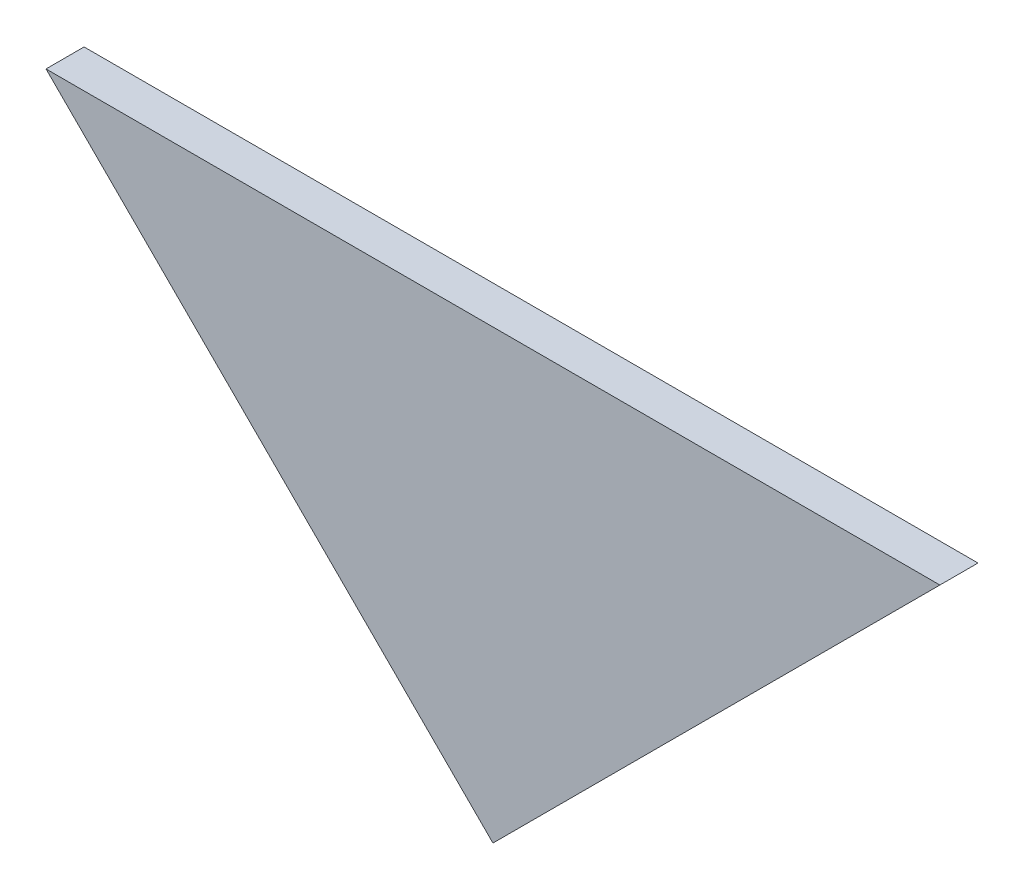
ISO-10303-21;
HEADER;
FILE_DESCRIPTION(('STEP AP214'),'2;1');
FILE_NAME('part.step','',(''),(''),'','','');
FILE_SCHEMA(('AUTOMOTIVE_DESIGN { 1 0 10303 214 1 1 1 1 }'));
ENDSEC;
DATA;
#1=APPLICATION_CONTEXT('core data for automotive mechanical design processes');
#2=APPLICATION_PROTOCOL_DEFINITION('international standard','automotive_design',2000,#1);
#3=PRODUCT_CONTEXT('',#1,'mechanical');
#4=PRODUCT('Part','Part','',(#3));
#5=PRODUCT_RELATED_PRODUCT_CATEGORY('part','',(#4));
#6=PRODUCT_DEFINITION_FORMATION('','',#4);
#7=PRODUCT_DEFINITION_CONTEXT('part definition',#1,'design');
#8=PRODUCT_DEFINITION('design','',#6,#7);
#9=PRODUCT_DEFINITION_SHAPE('','',#8);
#10=(LENGTH_UNIT() NAMED_UNIT(*) SI_UNIT(.MILLI.,.METRE.));
#11=(NAMED_UNIT(*) PLANE_ANGLE_UNIT() SI_UNIT($,.RADIAN.));
#12=(NAMED_UNIT(*) SI_UNIT($,.STERADIAN.) SOLID_ANGLE_UNIT());
#13=UNCERTAINTY_MEASURE_WITH_UNIT(LENGTH_MEASURE(1.E-05),#10,'distance_accuracy_value','');
#14=(GEOMETRIC_REPRESENTATION_CONTEXT(3) GLOBAL_UNCERTAINTY_ASSIGNED_CONTEXT((#13)) GLOBAL_UNIT_ASSIGNED_CONTEXT((#10,
#11,#12)) REPRESENTATION_CONTEXT('',''));
#15=CARTESIAN_POINT('',(0.,0.,0.));
#16=DIRECTION('',(0.,0.,1.));
#17=DIRECTION('',(1.,0.,0.));
#18=AXIS2_PLACEMENT_3D('',#15,#16,#17);
#19=CARTESIAN_POINT('',(172.189194744263,37.4911311616296,11.90625));
#20=DIRECTION('',(0.,-1.,0.));
#21=DIRECTION('',(1.,0.,0.));
#22=AXIS2_PLACEMENT_3D('',#19,#20,#21);
#23=PLANE('',#22);
#24=DIRECTION('',(-1.,0.,0.));
#25=VECTOR('',#24,1.);
#26=CARTESIAN_POINT('',(172.189194744263,37.4911311616296,0.));
#27=LINE('',#26,#25);
#28=CARTESIAN_POINT('',(172.189194744263,37.4911311616296,0.));
#29=VERTEX_POINT('',#28);
#30=CARTESIAN_POINT('',(-107.210805255737,37.4911311616296,0.));
#31=VERTEX_POINT('',#30);
#32=EDGE_CURVE('E79',#29,#31,#27,.T.);
#33=ORIENTED_EDGE('',*,*,#32,.T.);
#34=DIRECTION('',(0.,0.,-1.));
#35=VECTOR('',#34,1.);
#36=CARTESIAN_POINT('',(-107.210805255737,37.4911311616296,11.90625));
#37=LINE('',#36,#35);
#38=CARTESIAN_POINT('',(-107.210805255737,37.4911311616296,11.90625));
#39=VERTEX_POINT('',#38);
#40=EDGE_CURVE('E11',#39,#31,#37,.T.);
#41=ORIENTED_EDGE('',*,*,#40,.F.);
#42=DIRECTION('',(-1.,0.,0.));
#43=VECTOR('',#42,1.);
#44=CARTESIAN_POINT('',(172.189194744263,37.4911311616296,11.90625));
#45=LINE('',#44,#43);
#46=CARTESIAN_POINT('',(172.189194744263,37.4911311616296,11.90625));
#47=VERTEX_POINT('',#46);
#48=EDGE_CURVE('E72',#47,#39,#45,.T.);
#49=ORIENTED_EDGE('',*,*,#48,.F.);
#50=DIRECTION('',(0.,0.,-1.));
#51=VECTOR('',#50,1.);
#52=CARTESIAN_POINT('',(172.189194744263,37.4911311616296,11.90625));
#53=LINE('',#52,#51);
#54=EDGE_CURVE('E80',#47,#29,#53,.T.);
#55=ORIENTED_EDGE('',*,*,#54,.T.);
#56=EDGE_LOOP('',(#33,#41,#49,#55));
#57=FACE_BOUND('',#56,.T.);
#58=ADVANCED_FACE('F32',(#57),#23,.F.);
#59=CARTESIAN_POINT('',(-107.210805255737,37.4911311616296,11.90625));
#60=DIRECTION('',(0.707106781186543,0.707106781186552,0.));
#61=DIRECTION('',(-0.707106781186552,0.707106781186543,0.));
#62=AXIS2_PLACEMENT_3D('',#59,#60,#61);
#63=PLANE('',#62);
#64=DIRECTION('',(0.707106781186552,-0.707106781186543,0.));
#65=VECTOR('',#64,1.);
#66=CARTESIAN_POINT('',(-107.210805255737,37.4911311616296,0.));
#67=LINE('',#66,#65);
#68=CARTESIAN_POINT('',(32.4891947442647,-102.208868838371,0.));
#69=VERTEX_POINT('',#68);
#70=EDGE_CURVE('E60',#31,#69,#67,.T.);
#71=ORIENTED_EDGE('',*,*,#70,.T.);
#72=DIRECTION('',(0.,0.,-1.));
#73=VECTOR('',#72,1.);
#74=CARTESIAN_POINT('',(32.4891947442647,-102.208868838371,11.90625));
#75=LINE('',#74,#73);
#76=CARTESIAN_POINT('',(32.4891947442647,-102.208868838371,11.90625));
#77=VERTEX_POINT('',#76);
#78=EDGE_CURVE('E40',#77,#69,#75,.T.);
#79=ORIENTED_EDGE('',*,*,#78,.F.);
#80=DIRECTION('',(0.707106781186552,-0.707106781186543,0.));
#81=VECTOR('',#80,1.);
#82=CARTESIAN_POINT('',(-107.210805255737,37.4911311616296,11.90625));
#83=LINE('',#82,#81);
#84=EDGE_CURVE('E68',#39,#77,#83,.T.);
#85=ORIENTED_EDGE('',*,*,#84,.F.);
#86=ORIENTED_EDGE('',*,*,#40,.T.);
#87=EDGE_LOOP('',(#71,#79,#85,#86));
#88=FACE_BOUND('',#87,.T.);
#89=ADVANCED_FACE('F69',(#88),#63,.F.);
#90=CARTESIAN_POINT('',(32.4891947442647,-102.208868838371,11.90625));
#91=DIRECTION('',(-0.707106781186554,0.707106781186541,0.));
#92=DIRECTION('',(-0.707106781186541,-0.707106781186554,0.));
#93=AXIS2_PLACEMENT_3D('',#90,#91,#92);
#94=PLANE('',#93);
#95=DIRECTION('',(0.707106781186541,0.707106781186554,0.));
#96=VECTOR('',#95,1.);
#97=CARTESIAN_POINT('',(32.4891947442647,-102.208868838371,0.));
#98=LINE('',#97,#96);
#99=EDGE_CURVE('E65',#69,#29,#98,.T.);
#100=ORIENTED_EDGE('',*,*,#99,.T.);
#101=ORIENTED_EDGE('',*,*,#54,.F.);
#102=DIRECTION('',(0.707106781186541,0.707106781186554,0.));
#103=VECTOR('',#102,1.);
#104=CARTESIAN_POINT('',(32.4891947442647,-102.208868838371,11.90625));
#105=LINE('',#104,#103);
#106=EDGE_CURVE('E48',#77,#47,#105,.T.);
#107=ORIENTED_EDGE('',*,*,#106,.F.);
#108=ORIENTED_EDGE('',*,*,#78,.T.);
#109=EDGE_LOOP('',(#100,#101,#107,#108));
#110=FACE_BOUND('',#109,.T.);
#111=ADVANCED_FACE('F87',(#110),#94,.F.);
#112=CARTESIAN_POINT('',(0.,0.,11.90625));
#113=DIRECTION('',(0.,0.,1.));
#114=DIRECTION('',(1.,0.,0.));
#115=AXIS2_PLACEMENT_3D('',#112,#113,#114);
#116=PLANE('',#115);
#117=ORIENTED_EDGE('',*,*,#48,.T.);
#118=ORIENTED_EDGE('',*,*,#84,.T.);
#119=ORIENTED_EDGE('',*,*,#106,.T.);
#120=EDGE_LOOP('',(#117,#118,#119));
#121=FACE_BOUND('',#120,.T.);
#122=ADVANCED_FACE('F75',(#121),#116,.T.);
#123=CARTESIAN_POINT('',(0.,0.,0.));
#124=DIRECTION('',(0.,0.,1.));
#125=DIRECTION('',(1.,0.,0.));
#126=AXIS2_PLACEMENT_3D('',#123,#124,#125);
#127=PLANE('',#126);
#128=ORIENTED_EDGE('',*,*,#32,.F.);
#129=ORIENTED_EDGE('',*,*,#99,.F.);
#130=ORIENTED_EDGE('',*,*,#70,.F.);
#131=EDGE_LOOP('',(#128,#129,#130));
#132=FACE_BOUND('',#131,.T.);
#133=ADVANCED_FACE('F88',(#132),#127,.F.);
#134=CLOSED_SHELL('',(#58,#89,#111,#122,#133));
#135=MANIFOLD_SOLID_BREP('B2',#134);
#136=ADVANCED_BREP_SHAPE_REPRESENTATION('',(#18,#135),#14);
#137=SHAPE_DEFINITION_REPRESENTATION(#9,#136);
ENDSEC;
END-ISO-10303-21;
